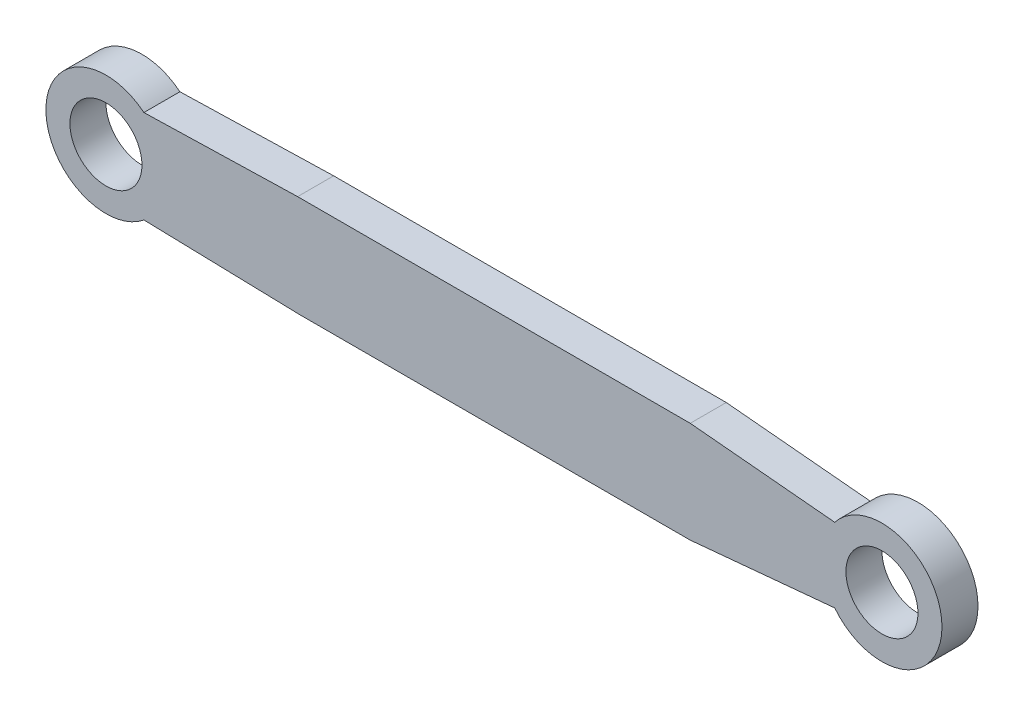
ISO-10303-21;
HEADER;
FILE_DESCRIPTION(('STEP AP214'),'2;1');
FILE_NAME('part.step','',(''),(''),'','','');
FILE_SCHEMA(('AUTOMOTIVE_DESIGN { 1 0 10303 214 1 1 1 1 }'));
ENDSEC;
DATA;
#1=APPLICATION_CONTEXT('core data for automotive mechanical design processes');
#2=APPLICATION_PROTOCOL_DEFINITION('international standard','automotive_design',2000,#1);
#3=PRODUCT_CONTEXT('',#1,'mechanical');
#4=PRODUCT('Part','Part','',(#3));
#5=PRODUCT_RELATED_PRODUCT_CATEGORY('part','',(#4));
#6=PRODUCT_DEFINITION_FORMATION('','',#4);
#7=PRODUCT_DEFINITION_CONTEXT('part definition',#1,'design');
#8=PRODUCT_DEFINITION('design','',#6,#7);
#9=PRODUCT_DEFINITION_SHAPE('','',#8);
#10=(LENGTH_UNIT() NAMED_UNIT(*) SI_UNIT(.MILLI.,.METRE.));
#11=(NAMED_UNIT(*) PLANE_ANGLE_UNIT() SI_UNIT($,.RADIAN.));
#12=(NAMED_UNIT(*) SI_UNIT($,.STERADIAN.) SOLID_ANGLE_UNIT());
#13=UNCERTAINTY_MEASURE_WITH_UNIT(LENGTH_MEASURE(1.E-05),#10,'distance_accuracy_value','');
#14=(GEOMETRIC_REPRESENTATION_CONTEXT(3) GLOBAL_UNCERTAINTY_ASSIGNED_CONTEXT((#13)) GLOBAL_UNIT_ASSIGNED_CONTEXT((#10,
#11,#12)) REPRESENTATION_CONTEXT('',''));
#15=CARTESIAN_POINT('',(0.,0.,0.));
#16=DIRECTION('',(0.,0.,1.));
#17=DIRECTION('',(1.,0.,0.));
#18=AXIS2_PLACEMENT_3D('',#15,#16,#17);
#19=CARTESIAN_POINT('',(-323.11762328,0.,30.));
#20=DIRECTION('',(0.,0.,-1.));
#21=DIRECTION('',(-1.,0.,0.));
#22=AXIS2_PLACEMENT_3D('',#19,#20,#21);
#23=CYLINDRICAL_SURFACE('',#22,50.);
#24=CARTESIAN_POINT('',(-323.11762328,0.,0.));
#25=DIRECTION('',(0.,0.,1.));
#26=DIRECTION('',(1.,0.,0.));
#27=AXIS2_PLACEMENT_3D('',#24,#25,#26);
#28=CIRCLE('',#27,50.);
#29=CARTESIAN_POINT('',(-291.506249587775,38.7391411016111,0.));
#30=VERTEX_POINT('',#29);
#31=CARTESIAN_POINT('',(-291.506249587775,-38.7391411016111,0.));
#32=VERTEX_POINT('',#31);
#33=EDGE_CURVE('E136',#30,#32,#28,.T.);
#34=ORIENTED_EDGE('',*,*,#33,.T.);
#35=DIRECTION('',(0.,0.,-1.));
#36=VECTOR('',#35,1.);
#37=CARTESIAN_POINT('',(-291.506249587775,-38.7391411016111,30.));
#38=LINE('',#37,#36);
#39=CARTESIAN_POINT('',(-291.506249587775,-38.7391411016111,30.));
#40=VERTEX_POINT('',#39);
#41=EDGE_CURVE('E11',#40,#32,#38,.T.);
#42=ORIENTED_EDGE('',*,*,#41,.F.);
#43=CARTESIAN_POINT('',(-323.11762328,0.,30.));
#44=DIRECTION('',(0.,0.,1.));
#45=DIRECTION('',(1.,0.,0.));
#46=AXIS2_PLACEMENT_3D('',#43,#44,#45);
#47=CIRCLE('',#46,50.);
#48=CARTESIAN_POINT('',(-291.506249587775,38.7391411016111,30.));
#49=VERTEX_POINT('',#48);
#50=EDGE_CURVE('E88',#49,#40,#47,.T.);
#51=ORIENTED_EDGE('',*,*,#50,.F.);
#52=DIRECTION('',(0.,0.,-1.));
#53=VECTOR('',#52,1.);
#54=CARTESIAN_POINT('',(-291.506249587775,38.7391411016111,30.));
#55=LINE('',#54,#53);
#56=EDGE_CURVE('E132',#49,#30,#55,.T.);
#57=ORIENTED_EDGE('',*,*,#56,.T.);
#58=EDGE_LOOP('',(#34,#42,#51,#57));
#59=FACE_BOUND('',#58,.T.);
#60=ADVANCED_FACE('F35',(#59),#23,.T.);
#61=CARTESIAN_POINT('',(-1.22024847297164,-46.3770012488194,30.));
#62=DIRECTION('',(-0.0263023971651654,-0.999654032104791,0.));
#63=DIRECTION('',(0.999654032104791,-0.0263023971651654,0.));
#64=AXIS2_PLACEMENT_3D('',#61,#62,#63);
#65=PLANE('',#64);
#66=DIRECTION('',(-0.999654032104791,0.0263023971651654,0.));
#67=VECTOR('',#66,1.);
#68=CARTESIAN_POINT('',(-1.22024847297164,-46.3770012488194,0.));
#69=LINE('',#68,#67);
#70=CARTESIAN_POINT('',(-161.55881164,-42.1582531281005,0.));
#71=VERTEX_POINT('',#70);
#72=EDGE_CURVE('E139',#71,#32,#69,.T.);
#73=ORIENTED_EDGE('',*,*,#72,.F.);
#74=DIRECTION('',(0.,0.,-1.));
#75=VECTOR('',#74,1.);
#76=CARTESIAN_POINT('',(-161.55881164,-42.1582531281005,30.));
#77=LINE('',#76,#75);
#78=CARTESIAN_POINT('',(-161.55881164,-42.1582531281005,30.));
#79=VERTEX_POINT('',#78);
#80=EDGE_CURVE('E44',#79,#71,#77,.T.);
#81=ORIENTED_EDGE('',*,*,#80,.F.);
#82=DIRECTION('',(-0.999654032104791,0.0263023971651654,0.));
#83=VECTOR('',#82,1.);
#84=CARTESIAN_POINT('',(-1.22024847297164,-46.3770012488194,30.));
#85=LINE('',#84,#83);
#86=EDGE_CURVE('E181',#79,#40,#85,.T.);
#87=ORIENTED_EDGE('',*,*,#86,.T.);
#88=ORIENTED_EDGE('',*,*,#41,.T.);
#89=EDGE_LOOP('',(#73,#81,#87,#88));
#90=FACE_BOUND('',#89,.T.);
#91=ADVANCED_FACE('F180',(#90),#65,.T.);
#92=CARTESIAN_POINT('',(0.,-42.1582531281005,30.));
#93=DIRECTION('',(0.,1.,0.));
#94=DIRECTION('',(0.,0.,1.));
#95=AXIS2_PLACEMENT_3D('',#92,#93,#94);
#96=PLANE('',#95);
#97=DIRECTION('',(1.,0.,0.));
#98=VECTOR('',#97,1.);
#99=CARTESIAN_POINT('',(0.,-42.1582531281005,0.));
#100=LINE('',#99,#98);
#101=CARTESIAN_POINT('',(163.480061578401,-42.1582531281005,0.));
#102=VERTEX_POINT('',#101);
#103=EDGE_CURVE('E142',#71,#102,#100,.T.);
#104=ORIENTED_EDGE('',*,*,#103,.T.);
#105=DIRECTION('',(0.,0.,-1.));
#106=VECTOR('',#105,1.);
#107=CARTESIAN_POINT('',(163.480061578401,-42.1582531281005,30.));
#108=LINE('',#107,#106);
#109=CARTESIAN_POINT('',(163.480061578401,-42.1582531281005,30.));
#110=VERTEX_POINT('',#109);
#111=EDGE_CURVE('E163',#110,#102,#108,.T.);
#112=ORIENTED_EDGE('',*,*,#111,.F.);
#113=DIRECTION('',(1.,0.,0.));
#114=VECTOR('',#113,1.);
#115=CARTESIAN_POINT('',(0.,-42.1582531281005,30.));
#116=LINE('',#115,#114);
#117=EDGE_CURVE('E170',#79,#110,#116,.T.);
#118=ORIENTED_EDGE('',*,*,#117,.F.);
#119=ORIENTED_EDGE('',*,*,#80,.T.);
#120=EDGE_LOOP('',(#104,#112,#118,#119));
#121=FACE_BOUND('',#120,.T.);
#122=ADVANCED_FACE('F168',(#121),#96,.F.);
#123=CARTESIAN_POINT('',(5.33629290357504,-56.9710622492057,30.));
#124=DIRECTION('',(-0.0932585201005226,0.995641927817757,0.));
#125=DIRECTION('',(-0.995641927817757,-0.0932585201005226,0.));
#126=AXIS2_PLACEMENT_3D('',#123,#124,#125);
#127=PLANE('',#126);
#128=DIRECTION('',(0.995641927817757,0.0932585201005226,0.));
#129=VECTOR('',#128,1.);
#130=CARTESIAN_POINT('',(5.33629290357504,-56.9710622492057,0.));
#131=LINE('',#130,#129);
#132=CARTESIAN_POINT('',(283.799540890193,-30.8883213721359,0.));
#133=VERTEX_POINT('',#132);
#134=EDGE_CURVE('E144',#102,#133,#131,.T.);
#135=ORIENTED_EDGE('',*,*,#134,.T.);
#136=DIRECTION('',(0.,0.,-1.));
#137=VECTOR('',#136,1.);
#138=CARTESIAN_POINT('',(283.799540890193,-30.8883213721359,30.));
#139=LINE('',#138,#137);
#140=CARTESIAN_POINT('',(283.799540890193,-30.8883213721359,30.));
#141=VERTEX_POINT('',#140);
#142=EDGE_CURVE('E160',#141,#133,#139,.T.);
#143=ORIENTED_EDGE('',*,*,#142,.F.);
#144=DIRECTION('',(0.995641927817757,0.0932585201005226,0.));
#145=VECTOR('',#144,1.);
#146=CARTESIAN_POINT('',(5.33629290357504,-56.9710622492057,30.));
#147=LINE('',#146,#145);
#148=EDGE_CURVE('E189',#110,#141,#147,.T.);
#149=ORIENTED_EDGE('',*,*,#148,.F.);
#150=ORIENTED_EDGE('',*,*,#111,.T.);
#151=EDGE_LOOP('',(#135,#143,#149,#150));
#152=FACE_BOUND('',#151,.T.);
#153=ADVANCED_FACE('F188',(#152),#127,.F.);
#154=CARTESIAN_POINT('',(323.11762328,0.,30.));
#155=DIRECTION('',(0.,0.,-1.));
#156=DIRECTION('',(-1.,0.,0.));
#157=AXIS2_PLACEMENT_3D('',#154,#155,#156);
#158=CYLINDRICAL_SURFACE('',#157,50.);
#159=CARTESIAN_POINT('',(323.11762328,0.,0.));
#160=DIRECTION('',(0.,0.,1.));
#161=DIRECTION('',(1.,0.,0.));
#162=AXIS2_PLACEMENT_3D('',#159,#160,#161);
#163=CIRCLE('',#162,50.);
#164=CARTESIAN_POINT('',(283.799540890193,30.8883213721359,0.));
#165=VERTEX_POINT('',#164);
#166=EDGE_CURVE('E146',#133,#165,#163,.T.);
#167=ORIENTED_EDGE('',*,*,#166,.T.);
#168=DIRECTION('',(0.,0.,-1.));
#169=VECTOR('',#168,1.);
#170=CARTESIAN_POINT('',(283.799540890193,30.8883213721359,30.));
#171=LINE('',#170,#169);
#172=CARTESIAN_POINT('',(283.799540890193,30.8883213721359,30.));
#173=VERTEX_POINT('',#172);
#174=EDGE_CURVE('E115',#173,#165,#171,.T.);
#175=ORIENTED_EDGE('',*,*,#174,.F.);
#176=CARTESIAN_POINT('',(323.11762328,0.,30.));
#177=DIRECTION('',(0.,0.,1.));
#178=DIRECTION('',(1.,0.,0.));
#179=AXIS2_PLACEMENT_3D('',#176,#177,#178);
#180=CIRCLE('',#179,50.);
#181=EDGE_CURVE('E121',#141,#173,#180,.T.);
#182=ORIENTED_EDGE('',*,*,#181,.F.);
#183=ORIENTED_EDGE('',*,*,#142,.T.);
#184=EDGE_LOOP('',(#167,#175,#182,#183));
#185=FACE_BOUND('',#184,.T.);
#186=ADVANCED_FACE('F184',(#185),#158,.T.);
#187=CARTESIAN_POINT('',(5.30635580999616,56.8724846926184,30.));
#188=DIRECTION('',(0.0928992042504304,0.995675518354065,0.));
#189=DIRECTION('',(-0.995675518354065,0.0928992042504304,0.));
#190=AXIS2_PLACEMENT_3D('',#187,#188,#189);
#191=PLANE('',#190);
#192=DIRECTION('',(0.995675518354065,-0.0928992042504304,0.));
#193=VECTOR('',#192,1.);
#194=CARTESIAN_POINT('',(5.30635580999616,56.8724846926184,0.));
#195=LINE('',#194,#193);
#196=CARTESIAN_POINT('',(163.480061578401,42.1144524538452,0.));
#197=VERTEX_POINT('',#196);
#198=EDGE_CURVE('E110',#197,#165,#195,.T.);
#199=ORIENTED_EDGE('',*,*,#198,.F.);
#200=DIRECTION('',(0.,0.,-1.));
#201=VECTOR('',#200,1.);
#202=CARTESIAN_POINT('',(163.480061578401,42.1144524538452,30.));
#203=LINE('',#202,#201);
#204=CARTESIAN_POINT('',(163.480061578401,42.1144524538452,30.));
#205=VERTEX_POINT('',#204);
#206=EDGE_CURVE('E105',#205,#197,#203,.T.);
#207=ORIENTED_EDGE('',*,*,#206,.F.);
#208=DIRECTION('',(0.995675518354065,-0.0928992042504304,0.));
#209=VECTOR('',#208,1.);
#210=CARTESIAN_POINT('',(5.30635580999616,56.8724846926184,30.));
#211=LINE('',#210,#209);
#212=EDGE_CURVE('E108',#205,#173,#211,.T.);
#213=ORIENTED_EDGE('',*,*,#212,.T.);
#214=ORIENTED_EDGE('',*,*,#174,.T.);
#215=EDGE_LOOP('',(#199,#207,#213,#214));
#216=FACE_BOUND('',#215,.T.);
#217=ADVANCED_FACE('F107',(#216),#191,.T.);
#218=CARTESIAN_POINT('',(0.,42.1144524538452,30.));
#219=DIRECTION('',(0.,1.,0.));
#220=DIRECTION('',(0.,0.,1.));
#221=AXIS2_PLACEMENT_3D('',#218,#219,#220);
#222=PLANE('',#221);
#223=DIRECTION('',(1.,0.,0.));
#224=VECTOR('',#223,1.);
#225=CARTESIAN_POINT('',(0.,42.1144524538452,0.));
#226=LINE('',#225,#224);
#227=CARTESIAN_POINT('',(-163.480061578401,42.1144524538452,0.));
#228=VERTEX_POINT('',#227);
#229=EDGE_CURVE('E150',#228,#197,#226,.T.);
#230=ORIENTED_EDGE('',*,*,#229,.F.);
#231=DIRECTION('',(0.,0.,-1.));
#232=VECTOR('',#231,1.);
#233=CARTESIAN_POINT('',(-163.480061578401,42.1144524538452,30.));
#234=LINE('',#233,#232);
#235=CARTESIAN_POINT('',(-163.480061578401,42.1144524538452,30.));
#236=VERTEX_POINT('',#235);
#237=EDGE_CURVE('E79',#236,#228,#234,.T.);
#238=ORIENTED_EDGE('',*,*,#237,.F.);
#239=DIRECTION('',(1.,0.,0.));
#240=VECTOR('',#239,1.);
#241=CARTESIAN_POINT('',(0.,42.1144524538452,30.));
#242=LINE('',#241,#240);
#243=EDGE_CURVE('E119',#236,#205,#242,.T.);
#244=ORIENTED_EDGE('',*,*,#243,.T.);
#245=ORIENTED_EDGE('',*,*,#206,.T.);
#246=EDGE_LOOP('',(#230,#238,#244,#245));
#247=FACE_BOUND('',#246,.T.);
#248=ADVANCED_FACE('F124',(#247),#222,.T.);
#249=CARTESIAN_POINT('',(-1.22309528244507,46.3922317803506,30.));
#250=DIRECTION('',(0.0263550682321696,-0.999652644861443,0.));
#251=DIRECTION('',(0.999652644861443,0.0263550682321696,0.));
#252=AXIS2_PLACEMENT_3D('',#249,#250,#251);
#253=PLANE('',#252);
#254=DIRECTION('',(-0.999652644861443,-0.0263550682321696,0.));
#255=VECTOR('',#254,1.);
#256=CARTESIAN_POINT('',(-1.22309528244507,46.3922317803506,0.));
#257=LINE('',#256,#255);
#258=EDGE_CURVE('E82',#228,#30,#257,.T.);
#259=ORIENTED_EDGE('',*,*,#258,.T.);
#260=ORIENTED_EDGE('',*,*,#56,.F.);
#261=DIRECTION('',(-0.999652644861443,-0.0263550682321696,0.));
#262=VECTOR('',#261,1.);
#263=CARTESIAN_POINT('',(-1.22309528244507,46.3922317803506,30.));
#264=LINE('',#263,#262);
#265=EDGE_CURVE('E52',#236,#49,#264,.T.);
#266=ORIENTED_EDGE('',*,*,#265,.F.);
#267=ORIENTED_EDGE('',*,*,#237,.T.);
#268=EDGE_LOOP('',(#259,#260,#266,#267));
#269=FACE_BOUND('',#268,.T.);
#270=ADVANCED_FACE('F227',(#269),#253,.F.);
#271=CARTESIAN_POINT('',(-323.11762328,0.,30.));
#272=DIRECTION('',(0.,0.,-1.));
#273=DIRECTION('',(-1.,0.,0.));
#274=AXIS2_PLACEMENT_3D('',#271,#272,#273);
#275=CYLINDRICAL_SURFACE('',#274,30.);
#276=CARTESIAN_POINT('',(-323.11762328,0.,30.));
#277=DIRECTION('',(0.,0.,1.));
#278=DIRECTION('',(1.,0.,0.));
#279=AXIS2_PLACEMENT_3D('',#276,#277,#278);
#280=CIRCLE('',#279,30.);
#281=CARTESIAN_POINT('',(-293.11762328,0.,30.));
#282=VERTEX_POINT('',#281);
#283=EDGE_CURVE('E156',#282,#282,#280,.T.);
#284=ORIENTED_EDGE('',*,*,#283,.T.);
#285=EDGE_LOOP('',(#284));
#286=FACE_BOUND('',#285,.T.);
#287=CARTESIAN_POINT('',(-323.11762328,0.,0.));
#288=DIRECTION('',(0.,0.,1.));
#289=DIRECTION('',(1.,0.,0.));
#290=AXIS2_PLACEMENT_3D('',#287,#288,#289);
#291=CIRCLE('',#290,30.);
#292=CARTESIAN_POINT('',(-293.11762328,0.,0.));
#293=VERTEX_POINT('',#292);
#294=EDGE_CURVE('E133',#293,#293,#291,.T.);
#295=ORIENTED_EDGE('',*,*,#294,.F.);
#296=EDGE_LOOP('',(#295));
#297=FACE_BOUND('',#296,.T.);
#298=ADVANCED_FACE('F37',(#286,#297),#275,.F.);
#299=CARTESIAN_POINT('',(323.11762328,0.,30.));
#300=DIRECTION('',(0.,0.,-1.));
#301=DIRECTION('',(-1.,0.,0.));
#302=AXIS2_PLACEMENT_3D('',#299,#300,#301);
#303=CYLINDRICAL_SURFACE('',#302,30.);
#304=CARTESIAN_POINT('',(323.11762328,0.,30.));
#305=DIRECTION('',(0.,0.,1.));
#306=DIRECTION('',(1.,0.,0.));
#307=AXIS2_PLACEMENT_3D('',#304,#305,#306);
#308=CIRCLE('',#307,30.);
#309=CARTESIAN_POINT('',(353.11762328,0.,30.));
#310=VERTEX_POINT('',#309);
#311=EDGE_CURVE('E126',#310,#310,#308,.T.);
#312=ORIENTED_EDGE('',*,*,#311,.T.);
#313=EDGE_LOOP('',(#312));
#314=FACE_BOUND('',#313,.T.);
#315=CARTESIAN_POINT('',(323.11762328,0.,0.));
#316=DIRECTION('',(0.,0.,1.));
#317=DIRECTION('',(1.,0.,0.));
#318=AXIS2_PLACEMENT_3D('',#315,#316,#317);
#319=CIRCLE('',#318,30.);
#320=CARTESIAN_POINT('',(353.11762328,0.,0.));
#321=VERTEX_POINT('',#320);
#322=EDGE_CURVE('E153',#321,#321,#319,.T.);
#323=ORIENTED_EDGE('',*,*,#322,.F.);
#324=EDGE_LOOP('',(#323));
#325=FACE_BOUND('',#324,.T.);
#326=ADVANCED_FACE('F201',(#314,#325),#303,.F.);
#327=CARTESIAN_POINT('',(0.,0.,30.));
#328=DIRECTION('',(0.,0.,1.));
#329=DIRECTION('',(1.,0.,0.));
#330=AXIS2_PLACEMENT_3D('',#327,#328,#329);
#331=PLANE('',#330);
#332=ORIENTED_EDGE('',*,*,#283,.F.);
#333=EDGE_LOOP('',(#332));
#334=FACE_BOUND('',#333,.T.);
#335=ORIENTED_EDGE('',*,*,#50,.T.);
#336=ORIENTED_EDGE('',*,*,#86,.F.);
#337=ORIENTED_EDGE('',*,*,#117,.T.);
#338=ORIENTED_EDGE('',*,*,#148,.T.);
#339=ORIENTED_EDGE('',*,*,#181,.T.);
#340=ORIENTED_EDGE('',*,*,#212,.F.);
#341=ORIENTED_EDGE('',*,*,#243,.F.);
#342=ORIENTED_EDGE('',*,*,#265,.T.);
#343=EDGE_LOOP('',(#335,#336,#337,#338,#339,#340,#341,#342));
#344=FACE_BOUND('',#343,.T.);
#345=ORIENTED_EDGE('',*,*,#311,.F.);
#346=EDGE_LOOP('',(#345));
#347=FACE_BOUND('',#346,.T.);
#348=ADVANCED_FACE('F117',(#334,#344,#347),#331,.T.);
#349=CARTESIAN_POINT('',(0.,0.,0.));
#350=DIRECTION('',(0.,0.,1.));
#351=DIRECTION('',(1.,0.,0.));
#352=AXIS2_PLACEMENT_3D('',#349,#350,#351);
#353=PLANE('',#352);
#354=ORIENTED_EDGE('',*,*,#294,.T.);
#355=EDGE_LOOP('',(#354));
#356=FACE_BOUND('',#355,.T.);
#357=ORIENTED_EDGE('',*,*,#33,.F.);
#358=ORIENTED_EDGE('',*,*,#258,.F.);
#359=ORIENTED_EDGE('',*,*,#229,.T.);
#360=ORIENTED_EDGE('',*,*,#198,.T.);
#361=ORIENTED_EDGE('',*,*,#166,.F.);
#362=ORIENTED_EDGE('',*,*,#134,.F.);
#363=ORIENTED_EDGE('',*,*,#103,.F.);
#364=ORIENTED_EDGE('',*,*,#72,.T.);
#365=EDGE_LOOP('',(#357,#358,#359,#360,#361,#362,#363,#364));
#366=FACE_BOUND('',#365,.T.);
#367=ORIENTED_EDGE('',*,*,#322,.T.);
#368=EDGE_LOOP('',(#367));
#369=FACE_BOUND('',#368,.T.);
#370=ADVANCED_FACE('F177',(#356,#366,#369),#353,.F.);
#371=CLOSED_SHELL('',(#60,#91,#122,#153,#186,#217,#248,#270,#298,#326,#348,#370));
#372=MANIFOLD_SOLID_BREP('B2',#371);
#373=ADVANCED_BREP_SHAPE_REPRESENTATION('',(#18,#372),#14);
#374=SHAPE_DEFINITION_REPRESENTATION(#9,#373);
ENDSEC;
END-ISO-10303-21;
